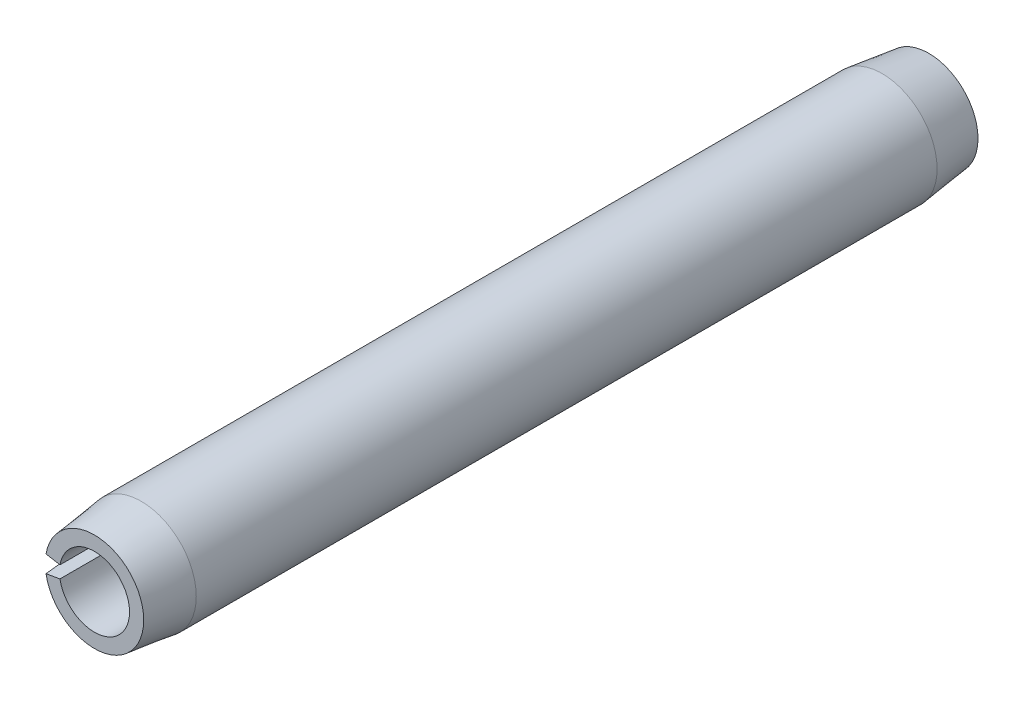
ISO-10303-21;
HEADER;
FILE_DESCRIPTION(('STEP AP214'),'2;1');
FILE_NAME('part.step','',(''),(''),'','','');
FILE_SCHEMA(('AUTOMOTIVE_DESIGN { 1 0 10303 214 1 1 1 1 }'));
ENDSEC;
DATA;
#1=APPLICATION_CONTEXT('core data for automotive mechanical design processes');
#2=APPLICATION_PROTOCOL_DEFINITION('international standard','automotive_design',2000,#1);
#3=PRODUCT_CONTEXT('',#1,'mechanical');
#4=PRODUCT('Part','Part','',(#3));
#5=PRODUCT_RELATED_PRODUCT_CATEGORY('part','',(#4));
#6=PRODUCT_DEFINITION_FORMATION('','',#4);
#7=PRODUCT_DEFINITION_CONTEXT('part definition',#1,'design');
#8=PRODUCT_DEFINITION('design','',#6,#7);
#9=PRODUCT_DEFINITION_SHAPE('','',#8);
#10=(LENGTH_UNIT() NAMED_UNIT(*) SI_UNIT(.MILLI.,.METRE.));
#11=(NAMED_UNIT(*) PLANE_ANGLE_UNIT() SI_UNIT($,.RADIAN.));
#12=(NAMED_UNIT(*) SI_UNIT($,.STERADIAN.) SOLID_ANGLE_UNIT());
#13=UNCERTAINTY_MEASURE_WITH_UNIT(LENGTH_MEASURE(1.E-05),#10,'distance_accuracy_value','');
#14=(GEOMETRIC_REPRESENTATION_CONTEXT(3) GLOBAL_UNCERTAINTY_ASSIGNED_CONTEXT((#13)) GLOBAL_UNIT_ASSIGNED_CONTEXT((#10,
#11,#12)) REPRESENTATION_CONTEXT('',''));
#15=CARTESIAN_POINT('',(0.,0.,0.));
#16=DIRECTION('',(0.,0.,1.));
#17=DIRECTION('',(1.,0.,0.));
#18=AXIS2_PLACEMENT_3D('',#15,#16,#17);
#19=CARTESIAN_POINT('',(0.,0.,6.35));
#20=DIRECTION('',(0.,0.,-1.));
#21=DIRECTION('',(-1.,0.,0.));
#22=AXIS2_PLACEMENT_3D('',#19,#20,#21);
#23=CYLINDRICAL_SURFACE('',#22,0.5334);
#24=CARTESIAN_POINT('',(0.,0.,-6.35));
#25=DIRECTION('',(0.,0.,-1.));
#26=DIRECTION('',(1.,0.,0.));
#27=AXIS2_PLACEMENT_3D('',#24,#25,#26);
#28=CIRCLE('',#27,0.5334);
#29=CARTESIAN_POINT('',(-0.525296455456712,0.0926239379675389,-6.35));
#30=VERTEX_POINT('',#29);
#31=CARTESIAN_POINT('',(-0.525296455456712,-0.0926239379675389,-6.35));
#32=VERTEX_POINT('',#31);
#33=EDGE_CURVE('E115',#30,#32,#28,.T.);
#34=ORIENTED_EDGE('',*,*,#33,.T.);
#35=DIRECTION('',(0.,0.,-1.));
#36=VECTOR('',#35,1.);
#37=CARTESIAN_POINT('',(-0.525296455456712,-0.0926239379675389,6.35));
#38=LINE('',#37,#36);
#39=CARTESIAN_POINT('',(-0.525296455456712,-0.0926239379675389,6.35));
#40=VERTEX_POINT('',#39);
#41=EDGE_CURVE('E11',#40,#32,#38,.T.);
#42=ORIENTED_EDGE('',*,*,#41,.F.);
#43=CARTESIAN_POINT('',(0.,0.,6.35));
#44=DIRECTION('',(0.,0.,-1.));
#45=DIRECTION('',(1.,0.,0.));
#46=AXIS2_PLACEMENT_3D('',#43,#44,#45);
#47=CIRCLE('',#46,0.5334);
#48=CARTESIAN_POINT('',(-0.525296455456712,0.0926239379675389,6.35));
#49=VERTEX_POINT('',#48);
#50=EDGE_CURVE('E111',#49,#40,#47,.T.);
#51=ORIENTED_EDGE('',*,*,#50,.F.);
#52=DIRECTION('',(0.,0.,-1.));
#53=VECTOR('',#52,1.);
#54=CARTESIAN_POINT('',(-0.525296455456712,0.0926239379675389,6.35));
#55=LINE('',#54,#53);
#56=EDGE_CURVE('E104',#49,#30,#55,.T.);
#57=ORIENTED_EDGE('',*,*,#56,.T.);
#58=EDGE_LOOP('',(#34,#42,#51,#57));
#59=FACE_BOUND('',#58,.T.);
#60=ADVANCED_FACE('F32',(#59),#23,.F.);
#61=CARTESIAN_POINT('',(-0.525296455456712,-0.0926239379675389,6.35));
#62=DIRECTION('',(0.173648177666927,-0.984807753012209,0.));
#63=DIRECTION('',(0.984807753012209,0.173648177666927,0.));
#64=AXIS2_PLACEMENT_3D('',#61,#62,#63);
#65=PLANE('',#64);
#66=DIRECTION('',(0.,0.,-1.));
#67=VECTOR('',#66,1.);
#68=CARTESIAN_POINT('',(-0.825465858574833,-0.145551902520418,6.35));
#69=LINE('',#68,#67);
#70=CARTESIAN_POINT('',(-0.825465858574835,-0.145551902520418,5.6388));
#71=VERTEX_POINT('',#70);
#72=CARTESIAN_POINT('',(-0.825465858574835,-0.145551902520418,-5.6388));
#73=VERTEX_POINT('',#72);
#74=EDGE_CURVE('E39',#71,#73,#69,.T.);
#75=ORIENTED_EDGE('',*,*,#74,.F.);
#76=DIRECTION('',(-0.122150368266264,-0.0215384056288171,-0.992277876713668));
#77=VECTOR('',#76,1.);
#78=CARTESIAN_POINT('',(0.,0.,12.3444));
#79=LINE('',#78,#77);
#80=CARTESIAN_POINT('',(-0.73791644933205,-0.130114579525829,6.35));
#81=VERTEX_POINT('',#80);
#82=EDGE_CURVE('E86',#71,#81,#79,.F.);
#83=ORIENTED_EDGE('',*,*,#82,.T.);
#84=DIRECTION('',(-0.984807753012209,-0.173648177666927,0.));
#85=VECTOR('',#84,1.);
#86=CARTESIAN_POINT('',(-0.525296455456712,-0.0926239379675389,6.35));
#87=LINE('',#86,#85);
#88=EDGE_CURVE('E119',#40,#81,#87,.T.);
#89=ORIENTED_EDGE('',*,*,#88,.F.);
#90=ORIENTED_EDGE('',*,*,#41,.T.);
#91=DIRECTION('',(-0.984807753012209,-0.173648177666927,0.));
#92=VECTOR('',#91,1.);
#93=CARTESIAN_POINT('',(-0.525296455456712,-0.0926239379675389,-6.35));
#94=LINE('',#93,#92);
#95=CARTESIAN_POINT('',(-0.73791644933205,-0.130114579525829,-6.35));
#96=VERTEX_POINT('',#95);
#97=EDGE_CURVE('E112',#32,#96,#94,.T.);
#98=ORIENTED_EDGE('',*,*,#97,.T.);
#99=DIRECTION('',(0.122150368266264,0.0215384056288171,-0.992277876713668));
#100=VECTOR('',#99,1.);
#101=CARTESIAN_POINT('',(0.,0.,-12.3444));
#102=LINE('',#101,#100);
#103=EDGE_CURVE('E54',#96,#73,#102,.F.);
#104=ORIENTED_EDGE('',*,*,#103,.T.);
#105=EDGE_LOOP('',(#75,#83,#89,#90,#98,#104));
#106=FACE_BOUND('',#105,.T.);
#107=ADVANCED_FACE('F133',(#106),#65,.F.);
#108=CARTESIAN_POINT('',(0.,0.,6.35));
#109=DIRECTION('',(0.,0.,-1.));
#110=DIRECTION('',(-1.,0.,0.));
#111=AXIS2_PLACEMENT_3D('',#108,#109,#110);
#112=CYLINDRICAL_SURFACE('',#111,0.8382);
#113=DIRECTION('',(0.,0.,-1.));
#114=VECTOR('',#113,1.);
#115=CARTESIAN_POINT('',(-0.825465858574833,0.145551902520418,6.35));
#116=LINE('',#115,#114);
#117=CARTESIAN_POINT('',(-0.825465858574835,0.145551902520419,5.6388));
#118=VERTEX_POINT('',#117);
#119=CARTESIAN_POINT('',(-0.825465858574834,0.145551902520419,-5.6388));
#120=VERTEX_POINT('',#119);
#121=EDGE_CURVE('E96',#118,#120,#116,.T.);
#122=ORIENTED_EDGE('',*,*,#121,.F.);
#123=CARTESIAN_POINT('',(0.,0.,5.6388));
#124=DIRECTION('',(0.,0.,-1.));
#125=DIRECTION('',(-1.,0.,0.));
#126=AXIS2_PLACEMENT_3D('',#123,#124,#125);
#127=CIRCLE('',#126,0.838200000000002);
#128=EDGE_CURVE('E83',#118,#71,#127,.T.);
#129=ORIENTED_EDGE('',*,*,#128,.T.);
#130=ORIENTED_EDGE('',*,*,#74,.T.);
#131=CARTESIAN_POINT('',(0.,0.,-5.6388));
#132=DIRECTION('',(0.,0.,-1.));
#133=DIRECTION('',(-1.,0.,0.));
#134=AXIS2_PLACEMENT_3D('',#131,#132,#133);
#135=CIRCLE('',#134,0.838200000000002);
#136=EDGE_CURVE('E103',#120,#73,#135,.T.);
#137=ORIENTED_EDGE('',*,*,#136,.F.);
#138=EDGE_LOOP('',(#122,#129,#130,#137));
#139=FACE_BOUND('',#138,.T.);
#140=ADVANCED_FACE('F102',(#139),#112,.T.);
#141=CARTESIAN_POINT('',(-0.825465858574833,0.145551902520418,6.35));
#142=DIRECTION('',(0.173648177666927,0.984807753012209,0.));
#143=DIRECTION('',(-0.984807753012209,0.173648177666927,0.));
#144=AXIS2_PLACEMENT_3D('',#141,#142,#143);
#145=PLANE('',#144);
#146=DIRECTION('',(0.984807753012209,-0.173648177666927,0.));
#147=VECTOR('',#146,1.);
#148=CARTESIAN_POINT('',(-0.825465858574833,0.145551902520418,6.35));
#149=LINE('',#148,#147);
#150=CARTESIAN_POINT('',(-0.737916449332049,0.130114579525829,6.35));
#151=VERTEX_POINT('',#150);
#152=EDGE_CURVE('E99',#151,#49,#149,.T.);
#153=ORIENTED_EDGE('',*,*,#152,.F.);
#154=DIRECTION('',(0.122150368266264,-0.0215384056288171,0.992277876713668));
#155=VECTOR('',#154,1.);
#156=CARTESIAN_POINT('',(0.,0.,12.3444));
#157=LINE('',#156,#155);
#158=EDGE_CURVE('E46',#151,#118,#157,.F.);
#159=ORIENTED_EDGE('',*,*,#158,.T.);
#160=ORIENTED_EDGE('',*,*,#121,.T.);
#161=DIRECTION('',(-0.122150368266264,0.0215384056288171,0.992277876713668));
#162=VECTOR('',#161,1.);
#163=CARTESIAN_POINT('',(0.,0.,-12.3444));
#164=LINE('',#163,#162);
#165=CARTESIAN_POINT('',(-0.737916449332049,0.130114579525829,-6.35));
#166=VERTEX_POINT('',#165);
#167=EDGE_CURVE('E125',#120,#166,#164,.F.);
#168=ORIENTED_EDGE('',*,*,#167,.T.);
#169=DIRECTION('',(0.984807753012209,-0.173648177666927,0.));
#170=VECTOR('',#169,1.);
#171=CARTESIAN_POINT('',(-0.825465858574833,0.145551902520418,-6.35));
#172=LINE('',#171,#170);
#173=EDGE_CURVE('E109',#166,#30,#172,.T.);
#174=ORIENTED_EDGE('',*,*,#173,.T.);
#175=ORIENTED_EDGE('',*,*,#56,.F.);
#176=EDGE_LOOP('',(#153,#159,#160,#168,#174,#175));
#177=FACE_BOUND('',#176,.T.);
#178=ADVANCED_FACE('F94',(#177),#145,.F.);
#179=CARTESIAN_POINT('',(0.,0.,6.35));
#180=DIRECTION('',(0.,0.,1.));
#181=DIRECTION('',(1.,0.,0.));
#182=AXIS2_PLACEMENT_3D('',#179,#180,#181);
#183=PLANE('',#182);
#184=CARTESIAN_POINT('',(0.,0.,6.35));
#185=DIRECTION('',(0.,0.,-1.));
#186=DIRECTION('',(-1.,0.,0.));
#187=AXIS2_PLACEMENT_3D('',#184,#185,#186);
#188=CIRCLE('',#187,0.749300000000001);
#189=EDGE_CURVE('E90',#151,#81,#188,.T.);
#190=ORIENTED_EDGE('',*,*,#189,.F.);
#191=ORIENTED_EDGE('',*,*,#152,.T.);
#192=ORIENTED_EDGE('',*,*,#50,.T.);
#193=ORIENTED_EDGE('',*,*,#88,.T.);
#194=EDGE_LOOP('',(#190,#191,#192,#193));
#195=FACE_BOUND('',#194,.T.);
#196=ADVANCED_FACE('F134',(#195),#183,.T.);
#197=CARTESIAN_POINT('',(0.,0.,-6.35));
#198=DIRECTION('',(0.,0.,1.));
#199=DIRECTION('',(1.,0.,0.));
#200=AXIS2_PLACEMENT_3D('',#197,#198,#199);
#201=PLANE('',#200);
#202=ORIENTED_EDGE('',*,*,#173,.F.);
#203=CARTESIAN_POINT('',(0.,0.,-6.35));
#204=DIRECTION('',(0.,0.,-1.));
#205=DIRECTION('',(-1.,0.,0.));
#206=AXIS2_PLACEMENT_3D('',#203,#204,#205);
#207=CIRCLE('',#206,0.749300000000001);
#208=EDGE_CURVE('E127',#166,#96,#207,.T.);
#209=ORIENTED_EDGE('',*,*,#208,.T.);
#210=ORIENTED_EDGE('',*,*,#97,.F.);
#211=ORIENTED_EDGE('',*,*,#33,.F.);
#212=EDGE_LOOP('',(#202,#209,#210,#211));
#213=FACE_BOUND('',#212,.T.);
#214=ADVANCED_FACE('F141',(#213),#201,.F.);
#215=CARTESIAN_POINT('',(0.,0.,-5.6388));
#216=DIRECTION('',(0.,0.,1.));
#217=DIRECTION('',(1.,0.,0.));
#218=AXIS2_PLACEMENT_3D('',#215,#216,#217);
#219=CONICAL_SURFACE('',#218,0.838200000000002,0.124354994546762);
#220=ORIENTED_EDGE('',*,*,#208,.F.);
#221=ORIENTED_EDGE('',*,*,#167,.F.);
#222=ORIENTED_EDGE('',*,*,#136,.T.);
#223=ORIENTED_EDGE('',*,*,#103,.F.);
#224=EDGE_LOOP('',(#220,#221,#222,#223));
#225=FACE_BOUND('',#224,.T.);
#226=ADVANCED_FACE('F142',(#225),#219,.T.);
#227=CARTESIAN_POINT('',(0.,0.,6.35));
#228=DIRECTION('',(0.,0.,-1.));
#229=DIRECTION('',(-1.,0.,0.));
#230=AXIS2_PLACEMENT_3D('',#227,#228,#229);
#231=CONICAL_SURFACE('',#230,0.749300000000001,0.124354994546762);
#232=ORIENTED_EDGE('',*,*,#128,.F.);
#233=ORIENTED_EDGE('',*,*,#158,.F.);
#234=ORIENTED_EDGE('',*,*,#189,.T.);
#235=ORIENTED_EDGE('',*,*,#82,.F.);
#236=EDGE_LOOP('',(#232,#233,#234,#235));
#237=FACE_BOUND('',#236,.T.);
#238=ADVANCED_FACE('F84',(#237),#231,.T.);
#239=CLOSED_SHELL('',(#60,#107,#140,#178,#196,#214,#226,#238));
#240=MANIFOLD_SOLID_BREP('B2',#239);
#241=ADVANCED_BREP_SHAPE_REPRESENTATION('',(#18,#240),#14);
#242=SHAPE_DEFINITION_REPRESENTATION(#9,#241);
ENDSEC;
END-ISO-10303-21;
